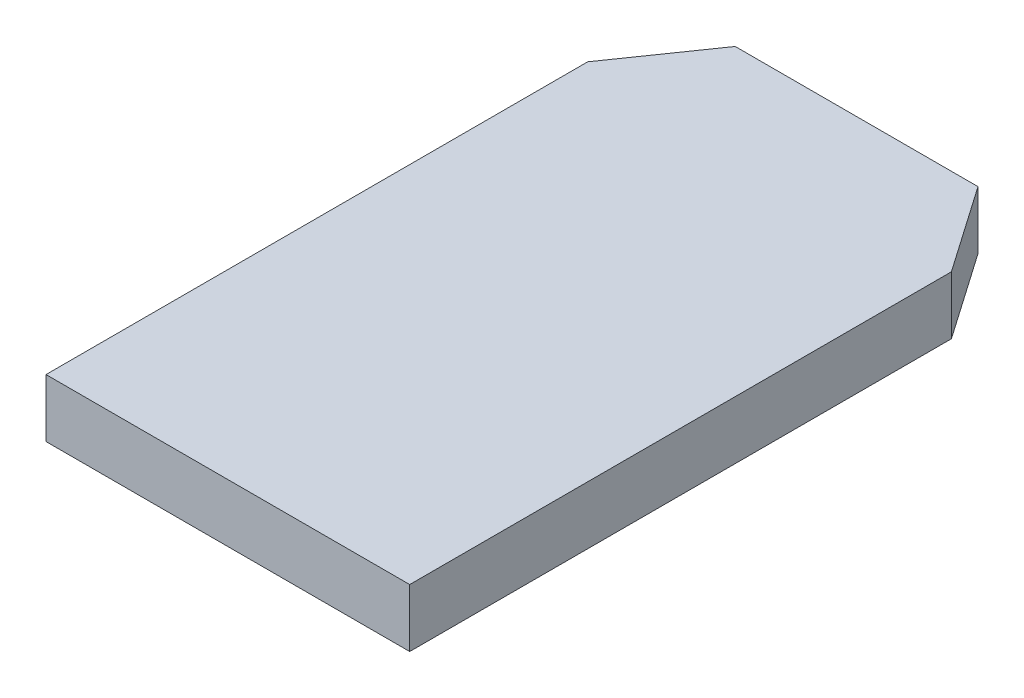
ISO-10303-21;
HEADER;
FILE_DESCRIPTION(('STEP AP214'),'2;1');
FILE_NAME('part.step','',(''),(''),'','','');
FILE_SCHEMA(('AUTOMOTIVE_DESIGN { 1 0 10303 214 1 1 1 1 }'));
ENDSEC;
DATA;
#1=APPLICATION_CONTEXT('core data for automotive mechanical design processes');
#2=APPLICATION_PROTOCOL_DEFINITION('international standard','automotive_design',2000,#1);
#3=PRODUCT_CONTEXT('',#1,'mechanical');
#4=PRODUCT('Part','Part','',(#3));
#5=PRODUCT_RELATED_PRODUCT_CATEGORY('part','',(#4));
#6=PRODUCT_DEFINITION_FORMATION('','',#4);
#7=PRODUCT_DEFINITION_CONTEXT('part definition',#1,'design');
#8=PRODUCT_DEFINITION('design','',#6,#7);
#9=PRODUCT_DEFINITION_SHAPE('','',#8);
#10=(LENGTH_UNIT() NAMED_UNIT(*) SI_UNIT(.MILLI.,.METRE.));
#11=(NAMED_UNIT(*) PLANE_ANGLE_UNIT() SI_UNIT($,.RADIAN.));
#12=(NAMED_UNIT(*) SI_UNIT($,.STERADIAN.) SOLID_ANGLE_UNIT());
#13=UNCERTAINTY_MEASURE_WITH_UNIT(LENGTH_MEASURE(1.E-05),#10,'distance_accuracy_value','');
#14=(GEOMETRIC_REPRESENTATION_CONTEXT(3) GLOBAL_UNCERTAINTY_ASSIGNED_CONTEXT((#13)) GLOBAL_UNIT_ASSIGNED_CONTEXT((#10,
#11,#12)) REPRESENTATION_CONTEXT('',''));
#15=CARTESIAN_POINT('',(0.,0.,0.));
#16=DIRECTION('',(0.,0.,1.));
#17=DIRECTION('',(1.,0.,0.));
#18=AXIS2_PLACEMENT_3D('',#15,#16,#17);
#19=CARTESIAN_POINT('',(2.85114999999983,16.5798500000004,-12.8778000000013));
#20=DIRECTION('',(0.,-1.,0.));
#21=DIRECTION('',(1.,0.,0.));
#22=AXIS2_PLACEMENT_3D('',#19,#20,#21);
#23=PLANE('',#22);
#24=DIRECTION('',(-0.570395809495344,0.,0.821369965673296));
#25=VECTOR('',#24,1.);
#26=CARTESIAN_POINT('',(3.24802499999983,16.5798500000004,-20.5613000000013));
#27=LINE('',#26,#25);
#28=CARTESIAN_POINT('',(3.64489999999982,16.5798500000004,-21.1328000000013));
#29=VERTEX_POINT('',#28);
#30=CARTESIAN_POINT('',(2.85114999999983,16.5798500000004,-19.9898000000013));
#31=VERTEX_POINT('',#30);
#32=EDGE_CURVE('E67',#29,#31,#27,.T.);
#33=ORIENTED_EDGE('',*,*,#32,.F.);
#34=DIRECTION('',(1.,0.,0.));
#35=VECTOR('',#34,1.);
#36=CARTESIAN_POINT('',(5.23874999999983,16.5798500000004,-21.1328000000013));
#37=LINE('',#36,#35);
#38=CARTESIAN_POINT('',(6.83259999999983,16.5798500000004,-21.1328000000013));
#39=VERTEX_POINT('',#38);
#40=EDGE_CURVE('E69',#29,#39,#37,.T.);
#41=ORIENTED_EDGE('',*,*,#40,.T.);
#42=DIRECTION('',(-0.570395809495344,0.,-0.821369965673296));
#43=VECTOR('',#42,1.);
#44=CARTESIAN_POINT('',(7.22947499999982,16.5798500000004,-20.5613000000013));
#45=LINE('',#44,#43);
#46=CARTESIAN_POINT('',(7.62634999999982,16.5798500000004,-19.9898000000013));
#47=VERTEX_POINT('',#46);
#48=EDGE_CURVE('E20',#47,#39,#45,.T.);
#49=ORIENTED_EDGE('',*,*,#48,.F.);
#50=DIRECTION('',(0.,0.,-1.));
#51=VECTOR('',#50,1.);
#52=CARTESIAN_POINT('',(7.62634999999982,16.5798500000004,-12.8778000000013));
#53=LINE('',#52,#51);
#54=CARTESIAN_POINT('',(7.62634999999982,16.5798500000004,-12.8778000000019));
#55=VERTEX_POINT('',#54);
#56=EDGE_CURVE('E104',#55,#47,#53,.T.);
#57=ORIENTED_EDGE('',*,*,#56,.F.);
#58=DIRECTION('',(-1.,0.,0.));
#59=VECTOR('',#58,1.);
#60=CARTESIAN_POINT('',(-3.01980662698043E-13,16.5798500000004,-12.8778000000025));
#61=LINE('',#60,#59);
#62=CARTESIAN_POINT('',(2.85114999999983,16.5798500000004,-12.8778000000016));
#63=VERTEX_POINT('',#62);
#64=EDGE_CURVE('E98',#55,#63,#61,.T.);
#65=ORIENTED_EDGE('',*,*,#64,.T.);
#66=DIRECTION('',(0.,0.,1.));
#67=VECTOR('',#66,1.);
#68=CARTESIAN_POINT('',(2.85114999999982,16.5798500000004,-12.8778000000013));
#69=LINE('',#68,#67);
#70=EDGE_CURVE('E95',#31,#63,#69,.T.);
#71=ORIENTED_EDGE('',*,*,#70,.F.);
#72=EDGE_LOOP('',(#33,#41,#49,#57,#65,#71));
#73=FACE_BOUND('',#72,.T.);
#74=ADVANCED_FACE('F17',(#73),#23,.T.);
#75=CARTESIAN_POINT('',(7.22947499999982,16.7703500000004,-20.5613000000013));
#76=DIRECTION('',(0.821369965673296,0.,-0.570395809495344));
#77=DIRECTION('',(-0.570395809495344,0.,-0.821369965673296));
#78=AXIS2_PLACEMENT_3D('',#75,#76,#77);
#79=PLANE('',#78);
#80=ORIENTED_EDGE('',*,*,#48,.T.);
#81=DIRECTION('',(0.,1.,0.));
#82=VECTOR('',#81,1.);
#83=CARTESIAN_POINT('',(6.83259999999983,16.9608500000004,-21.1328000000013));
#84=LINE('',#83,#82);
#85=CARTESIAN_POINT('',(6.83259999999982,17.3418500000004,-21.1328000000013));
#86=VERTEX_POINT('',#85);
#87=EDGE_CURVE('E76',#39,#86,#84,.T.);
#88=ORIENTED_EDGE('',*,*,#87,.T.);
#89=DIRECTION('',(-0.570395809495348,0.,-0.821369965673293));
#90=VECTOR('',#89,1.);
#91=CARTESIAN_POINT('',(7.62634999999982,17.3418500000004,-19.9898000000013));
#92=LINE('',#91,#90);
#93=CARTESIAN_POINT('',(7.62634999999982,17.3418500000004,-19.9898000000013));
#94=VERTEX_POINT('',#93);
#95=EDGE_CURVE('E106',#94,#86,#92,.T.);
#96=ORIENTED_EDGE('',*,*,#95,.F.);
#97=DIRECTION('',(0.,1.,0.));
#98=VECTOR('',#97,1.);
#99=CARTESIAN_POINT('',(7.62634999999982,16.5798500000004,-19.9898000000013));
#100=LINE('',#99,#98);
#101=EDGE_CURVE('E81',#47,#94,#100,.T.);
#102=ORIENTED_EDGE('',*,*,#101,.F.);
#103=EDGE_LOOP('',(#80,#88,#96,#102));
#104=FACE_BOUND('',#103,.T.);
#105=ADVANCED_FACE('F78',(#104),#79,.T.);
#106=CARTESIAN_POINT('',(5.23874999999983,16.9608500000004,-21.1328000000013));
#107=DIRECTION('',(0.,0.,1.));
#108=DIRECTION('',(1.,0.,0.));
#109=AXIS2_PLACEMENT_3D('',#106,#107,#108);
#110=PLANE('',#109);
#111=ORIENTED_EDGE('',*,*,#40,.F.);
#112=DIRECTION('',(0.,1.,0.));
#113=VECTOR('',#112,1.);
#114=CARTESIAN_POINT('',(3.64489999999983,17.1513500000004,-21.1328000000013));
#115=LINE('',#114,#113);
#116=CARTESIAN_POINT('',(3.64489999999982,17.3418500000004,-21.1328000000013));
#117=VERTEX_POINT('',#116);
#118=EDGE_CURVE('E88',#117,#29,#115,.F.);
#119=ORIENTED_EDGE('',*,*,#118,.F.);
#120=DIRECTION('',(-1.,0.,0.));
#121=VECTOR('',#120,1.);
#122=CARTESIAN_POINT('',(7.62634999999982,17.3418500000004,-21.1328000000013));
#123=LINE('',#122,#121);
#124=EDGE_CURVE('E85',#86,#117,#123,.T.);
#125=ORIENTED_EDGE('',*,*,#124,.F.);
#126=ORIENTED_EDGE('',*,*,#87,.F.);
#127=EDGE_LOOP('',(#111,#119,#125,#126));
#128=FACE_BOUND('',#127,.T.);
#129=ADVANCED_FACE('F83',(#128),#110,.F.);
#130=CARTESIAN_POINT('',(3.24802499999983,17.1513500000004,-20.5613000000013));
#131=DIRECTION('',(-0.821369965673296,0.,-0.570395809495344));
#132=DIRECTION('',(-0.570395809495344,0.,0.821369965673296));
#133=AXIS2_PLACEMENT_3D('',#130,#131,#132);
#134=PLANE('',#133);
#135=DIRECTION('',(-0.570395809495344,0.,0.821369965673296));
#136=VECTOR('',#135,1.);
#137=CARTESIAN_POINT('',(3.64489999999982,17.3418500000004,-21.1328000000013));
#138=LINE('',#137,#136);
#139=CARTESIAN_POINT('',(2.85114999999982,17.3418500000004,-19.9898000000013));
#140=VERTEX_POINT('',#139);
#141=EDGE_CURVE('E109',#117,#140,#138,.T.);
#142=ORIENTED_EDGE('',*,*,#141,.F.);
#143=ORIENTED_EDGE('',*,*,#118,.T.);
#144=ORIENTED_EDGE('',*,*,#32,.T.);
#145=DIRECTION('',(0.,1.,0.));
#146=VECTOR('',#145,1.);
#147=CARTESIAN_POINT('',(2.85114999999982,17.3418500000004,-19.9898000000013));
#148=LINE('',#147,#146);
#149=EDGE_CURVE('E92',#140,#31,#148,.F.);
#150=ORIENTED_EDGE('',*,*,#149,.F.);
#151=EDGE_LOOP('',(#142,#143,#144,#150));
#152=FACE_BOUND('',#151,.T.);
#153=ADVANCED_FACE('F137',(#152),#134,.T.);
#154=CARTESIAN_POINT('',(2.85114999999982,17.3418500000004,-12.8778000000013));
#155=DIRECTION('',(-1.,0.,0.));
#156=DIRECTION('',(0.,0.,1.));
#157=AXIS2_PLACEMENT_3D('',#154,#155,#156);
#158=PLANE('',#157);
#159=DIRECTION('',(0.,1.,0.));
#160=VECTOR('',#159,1.);
#161=CARTESIAN_POINT('',(2.85114999999983,15.1130000000006,-12.8778000000025));
#162=LINE('',#161,#160);
#163=CARTESIAN_POINT('',(2.85114999999982,17.3418500000004,-12.8778000000016));
#164=VERTEX_POINT('',#163);
#165=EDGE_CURVE('E100',#63,#164,#162,.T.);
#166=ORIENTED_EDGE('',*,*,#165,.T.);
#167=DIRECTION('',(0.,0.,1.));
#168=VECTOR('',#167,1.);
#169=CARTESIAN_POINT('',(2.85114999999982,17.3418500000004,-12.8778000000013));
#170=LINE('',#169,#168);
#171=EDGE_CURVE('E112',#140,#164,#170,.T.);
#172=ORIENTED_EDGE('',*,*,#171,.F.);
#173=ORIENTED_EDGE('',*,*,#149,.T.);
#174=ORIENTED_EDGE('',*,*,#70,.T.);
#175=EDGE_LOOP('',(#166,#172,#173,#174));
#176=FACE_BOUND('',#175,.T.);
#177=ADVANCED_FACE('F122',(#176),#158,.T.);
#178=CARTESIAN_POINT('',(-3.01980662698043E-13,15.1130000000006,-12.8778000000025));
#179=DIRECTION('',(0.,0.,-1.));
#180=DIRECTION('',(-1.,0.,0.));
#181=AXIS2_PLACEMENT_3D('',#178,#179,#180);
#182=PLANE('',#181);
#183=ORIENTED_EDGE('',*,*,#165,.F.);
#184=ORIENTED_EDGE('',*,*,#64,.F.);
#185=DIRECTION('',(0.,1.,0.));
#186=VECTOR('',#185,1.);
#187=CARTESIAN_POINT('',(7.62634999999982,16.5798500000004,-12.8778000000013));
#188=LINE('',#187,#186);
#189=CARTESIAN_POINT('',(7.62634999999982,17.3418500000004,-12.8778000000019));
#190=VERTEX_POINT('',#189);
#191=EDGE_CURVE('E35',#190,#55,#188,.F.);
#192=ORIENTED_EDGE('',*,*,#191,.F.);
#193=DIRECTION('',(-1.,0.,0.));
#194=VECTOR('',#193,1.);
#195=CARTESIAN_POINT('',(7.62634999999982,17.3418500000004,-12.8778000000013));
#196=LINE('',#195,#194);
#197=EDGE_CURVE('E26',#164,#190,#196,.F.);
#198=ORIENTED_EDGE('',*,*,#197,.F.);
#199=EDGE_LOOP('',(#183,#184,#192,#198));
#200=FACE_BOUND('',#199,.T.);
#201=ADVANCED_FACE('F120',(#200),#182,.F.);
#202=CARTESIAN_POINT('',(7.62634999999982,16.5798500000004,-12.8778000000013));
#203=DIRECTION('',(1.,0.,0.));
#204=DIRECTION('',(0.,0.,-1.));
#205=AXIS2_PLACEMENT_3D('',#202,#203,#204);
#206=PLANE('',#205);
#207=ORIENTED_EDGE('',*,*,#191,.T.);
#208=ORIENTED_EDGE('',*,*,#56,.T.);
#209=ORIENTED_EDGE('',*,*,#101,.T.);
#210=DIRECTION('',(0.,0.,1.));
#211=VECTOR('',#210,1.);
#212=CARTESIAN_POINT('',(7.62634999999982,17.3418500000004,-12.8778000000013));
#213=LINE('',#212,#211);
#214=EDGE_CURVE('E11',#190,#94,#213,.F.);
#215=ORIENTED_EDGE('',*,*,#214,.F.);
#216=EDGE_LOOP('',(#207,#208,#209,#215));
#217=FACE_BOUND('',#216,.T.);
#218=ADVANCED_FACE('F124',(#217),#206,.T.);
#219=CARTESIAN_POINT('',(7.62634999999982,17.3418500000004,-12.8778000000013));
#220=DIRECTION('',(0.,1.,0.));
#221=DIRECTION('',(-1.,0.,0.));
#222=AXIS2_PLACEMENT_3D('',#219,#220,#221);
#223=PLANE('',#222);
#224=ORIENTED_EDGE('',*,*,#197,.T.);
#225=ORIENTED_EDGE('',*,*,#214,.T.);
#226=ORIENTED_EDGE('',*,*,#95,.T.);
#227=ORIENTED_EDGE('',*,*,#124,.T.);
#228=ORIENTED_EDGE('',*,*,#141,.T.);
#229=ORIENTED_EDGE('',*,*,#171,.T.);
#230=EDGE_LOOP('',(#224,#225,#226,#227,#228,#229));
#231=FACE_BOUND('',#230,.T.);
#232=ADVANCED_FACE('F117',(#231),#223,.T.);
#233=CLOSED_SHELL('',(#74,#105,#129,#153,#177,#201,#218,#232));
#234=MANIFOLD_SOLID_BREP('B1',#233);
#235=ADVANCED_BREP_SHAPE_REPRESENTATION('',(#18,#234),#14);
#236=SHAPE_DEFINITION_REPRESENTATION(#9,#235);
ENDSEC;
END-ISO-10303-21;
